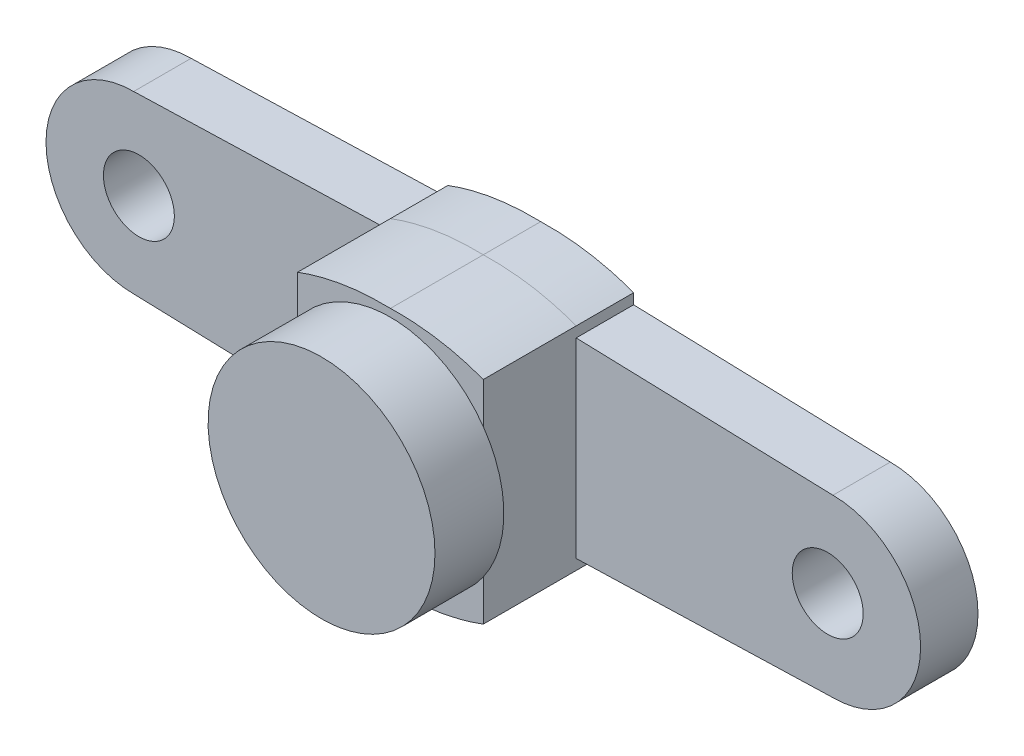
ISO-10303-21;
HEADER;
FILE_DESCRIPTION(('STEP AP214'),'2;1');
FILE_NAME('part.step','',(''),(''),'','','');
FILE_SCHEMA(('AUTOMOTIVE_DESIGN { 1 0 10303 214 1 1 1 1 }'));
ENDSEC;
DATA;
#1=APPLICATION_CONTEXT('core data for automotive mechanical design processes');
#2=APPLICATION_PROTOCOL_DEFINITION('international standard','automotive_design',2000,#1);
#3=PRODUCT_CONTEXT('',#1,'mechanical');
#4=PRODUCT('Part','Part','',(#3));
#5=PRODUCT_RELATED_PRODUCT_CATEGORY('part','',(#4));
#6=PRODUCT_DEFINITION_FORMATION('','',#4);
#7=PRODUCT_DEFINITION_CONTEXT('part definition',#1,'design');
#8=PRODUCT_DEFINITION('design','',#6,#7);
#9=PRODUCT_DEFINITION_SHAPE('','',#8);
#10=(LENGTH_UNIT() NAMED_UNIT(*) SI_UNIT(.MILLI.,.METRE.));
#11=(NAMED_UNIT(*) PLANE_ANGLE_UNIT() SI_UNIT($,.RADIAN.));
#12=(NAMED_UNIT(*) SI_UNIT($,.STERADIAN.) SOLID_ANGLE_UNIT());
#13=UNCERTAINTY_MEASURE_WITH_UNIT(LENGTH_MEASURE(1.E-05),#10,'distance_accuracy_value','');
#14=(GEOMETRIC_REPRESENTATION_CONTEXT(3) GLOBAL_UNCERTAINTY_ASSIGNED_CONTEXT((#13)) GLOBAL_UNIT_ASSIGNED_CONTEXT((#10,
#11,#12)) REPRESENTATION_CONTEXT('',''));
#15=CARTESIAN_POINT('',(0.,0.,0.));
#16=DIRECTION('',(0.,0.,1.));
#17=DIRECTION('',(1.,0.,0.));
#18=AXIS2_PLACEMENT_3D('',#15,#16,#17);
#19=CARTESIAN_POINT('',(8.4853000278855,7.91872101342506,7.2));
#20=DIRECTION('',(0.,0.,1.));
#21=DIRECTION('',(1.,0.,0.));
#22=AXIS2_PLACEMENT_3D('',#19,#20,#21);
#23=PLANE('',#22);
#24=CARTESIAN_POINT('',(4.61101000871711,2.64714357478906,7.2));
#25=DIRECTION('',(0.,0.,1.));
#26=DIRECTION('',(1.,0.,0.));
#27=AXIS2_PLACEMENT_3D('',#24,#25,#26);
#28=CIRCLE('',#27,5.435);
#29=CARTESIAN_POINT('',(9.06101002019817,5.76751613232423,7.2));
#30=VERTEX_POINT('',#29);
#31=CARTESIAN_POINT('',(0.161010020198166,5.76751616507078,7.2));
#32=VERTEX_POINT('',#31);
#33=EDGE_CURVE('E47',#30,#32,#28,.T.);
#34=ORIENTED_EDGE('',*,*,#33,.F.);
#35=DIRECTION('',(0.,1.,0.));
#36=VECTOR('',#35,1.);
#37=CARTESIAN_POINT('',(9.06101002019817,-1.93096476807348,7.2));
#38=LINE('',#37,#36);
#39=CARTESIAN_POINT('',(9.06101002019817,7.71966469580309,7.2));
#40=VERTEX_POINT('',#39);
#41=EDGE_CURVE('E178',#30,#40,#38,.T.);
#42=ORIENTED_EDGE('',*,*,#41,.T.);
#43=CARTESIAN_POINT('',(-296383.383400373,-955070.191119898,7.2));
#44=CARTESIAN_POINT('',(300907.39833334,953663.959511073,7.2));
#45=CARTESIAN_POINT('',(-305397.472066195,-952226.053018193,7.2));
#46=B_SPLINE_CURVE_WITH_KNOTS('',2,(#43,#44,#45),.UNSPECIFIED.,.F.,.F.,(3,3),(0.,1.),.UNSPECIFIED.);
#47=CARTESIAN_POINT('',(4.611010008714,8.44423367993897,7.2));
#48=VERTEX_POINT('',#47);
#49=EDGE_CURVE('E197',#40,#48,#46,.T.);
#50=ORIENTED_EDGE('',*,*,#49,.T.);
#51=CARTESIAN_POINT('',(305406.694086235,-952226.053018194,7.2));
#52=CARTESIAN_POINT('',(-300898.176313299,953663.959511073,7.2));
#53=CARTESIAN_POINT('',(296392.605420413,-955070.191119898,7.2));
#54=B_SPLINE_CURVE_WITH_KNOTS('',2,(#51,#52,#53),.UNSPECIFIED.,.F.,.F.,(3,3),(0.,1.),.UNSPECIFIED.);
#55=CARTESIAN_POINT('',(0.161010020010455,7.7196646957563,7.2));
#56=VERTEX_POINT('',#55);
#57=EDGE_CURVE('E203',#48,#56,#54,.T.);
#58=ORIENTED_EDGE('',*,*,#57,.T.);
#59=DIRECTION('',(0.,-1.,0.));
#60=VECTOR('',#59,1.);
#61=CARTESIAN_POINT('',(0.161010020198171,7.71966469580309,7.2));
#62=LINE('',#61,#60);
#63=EDGE_CURVE('E504',#56,#32,#62,.T.);
#64=ORIENTED_EDGE('',*,*,#63,.T.);
#65=EDGE_LOOP('',(#34,#42,#50,#58,#64));
#66=FACE_BOUND('',#65,.T.);
#67=ADVANCED_FACE('F35',(#66),#23,.T.);
#68=CARTESIAN_POINT('',(0.,0.,2.75));
#69=DIRECTION('',(0.,0.,1.));
#70=DIRECTION('',(1.,0.,0.));
#71=AXIS2_PLACEMENT_3D('',#68,#69,#70);
#72=PLANE('',#71);
#73=DIRECTION('',(0.,1.,0.));
#74=VECTOR('',#73,1.);
#75=CARTESIAN_POINT('',(9.06101002019817,7.71966469580309,2.75));
#76=LINE('',#75,#74);
#77=CARTESIAN_POINT('',(9.06101002019817,-1.93096476807348,2.75));
#78=VERTEX_POINT('',#77);
#79=CARTESIAN_POINT('',(9.06101002019817,7.21943212732004,2.75));
#80=VERTEX_POINT('',#79);
#81=EDGE_CURVE('E45',#78,#80,#76,.T.);
#82=ORIENTED_EDGE('',*,*,#81,.F.);
#83=DIRECTION('',(0.999535079285719,0.0304897569241027,0.));
#84=VECTOR('',#83,1.);
#85=CARTESIAN_POINT('',(0.0672706183174681,-2.20530924470558,2.75));
#86=LINE('',#85,#84);
#87=CARTESIAN_POINT('',(21.3610100201982,-1.55576632037672,2.75));
#88=VERTEX_POINT('',#87);
#89=EDGE_CURVE('E264',#78,#88,#86,.T.);
#90=ORIENTED_EDGE('',*,*,#89,.T.);
#91=CARTESIAN_POINT('',(21.3610100201982,2.64423367962328,2.75));
#92=DIRECTION('',(0.,0.,1.));
#93=DIRECTION('',(1.,0.,0.));
#94=AXIS2_PLACEMENT_3D('',#91,#92,#93);
#95=CIRCLE('',#94,4.2);
#96=CARTESIAN_POINT('',(21.3610100201982,6.84423367962328,2.75));
#97=VERTEX_POINT('',#96);
#98=EDGE_CURVE('E270',#88,#97,#95,.T.);
#99=ORIENTED_EDGE('',*,*,#98,.T.);
#100=DIRECTION('',(0.999535079285719,-0.0304897569241024,0.));
#101=VECTOR('',#100,1.);
#102=CARTESIAN_POINT('',(0.228439736887106,7.48886031101686,2.75));
#103=LINE('',#102,#101);
#104=EDGE_CURVE('E275',#80,#97,#103,.T.);
#105=ORIENTED_EDGE('',*,*,#104,.F.);
#106=EDGE_LOOP('',(#82,#90,#99,#105));
#107=FACE_BOUND('',#106,.T.);
#108=CARTESIAN_POINT('',(21.1110100201982,2.64553279413696,2.75));
#109=DIRECTION('',(0.,0.,1.));
#110=DIRECTION('',(-1.,0.,0.));
#111=AXIS2_PLACEMENT_3D('',#108,#109,#110);
#112=CIRCLE('',#111,1.7);
#113=CARTESIAN_POINT('',(19.4110100201982,2.64553279413696,2.75));
#114=VERTEX_POINT('',#113);
#115=EDGE_CURVE('E424',#114,#114,#112,.T.);
#116=ORIENTED_EDGE('',*,*,#115,.F.);
#117=EDGE_LOOP('',(#116));
#118=FACE_BOUND('',#117,.T.);
#119=ADVANCED_FACE('F232',(#107,#118),#72,.T.);
#120=CARTESIAN_POINT('',(4.61101002019817,8.44423367962328,2.75));
#121=CARTESIAN_POINT('',(6.97010391828629,8.50694060644477,2.75));
#122=CARTESIAN_POINT('',(9.06101002019817,7.71966469580309,2.75));
#123=B_SPLINE_CURVE_WITH_KNOTS('',2,(#120,#121,#122),.UNSPECIFIED.,.F.,.F.,(3,3),(0.,
0.687711527241185),.UNSPECIFIED.);
#124=DIRECTION('',(0.,0.,-1.));
#125=VECTOR('',#124,1.);
#126=SURFACE_OF_LINEAR_EXTRUSION('',#123,#125);
#127=CARTESIAN_POINT('',(4.61101002019817,8.44423367962328,0.));
#128=CARTESIAN_POINT('',(6.97010391828629,8.50694060644477,0.));
#129=CARTESIAN_POINT('',(9.06101002019817,7.71966469580309,0.));
#130=B_SPLINE_CURVE_WITH_KNOTS('',2,(#127,#128,#129),.UNSPECIFIED.,.F.,.F.,(3,3),(0.,
0.687711527241185),.UNSPECIFIED.);
#131=CARTESIAN_POINT('',(4.61101002019817,8.44423367962328,0.));
#132=VERTEX_POINT('',#131);
#133=CARTESIAN_POINT('',(9.06101002019817,7.71966469580309,0.));
#134=VERTEX_POINT('',#133);
#135=EDGE_CURVE('E276',#132,#134,#130,.T.);
#136=ORIENTED_EDGE('',*,*,#135,.F.);
#137=DIRECTION('',(0.,0.,-1.));
#138=VECTOR('',#137,1.);
#139=CARTESIAN_POINT('',(4.61101002019817,8.44423367962328,2.75));
#140=LINE('',#139,#138);
#141=CARTESIAN_POINT('',(4.61101002019817,8.44423367962328,2.75));
#142=VERTEX_POINT('',#141);
#143=EDGE_CURVE('E361',#142,#132,#140,.T.);
#144=ORIENTED_EDGE('',*,*,#143,.F.);
#145=CARTESIAN_POINT('',(9.06101002019817,7.71966469580309,2.75));
#146=VERTEX_POINT('',#145);
#147=EDGE_CURVE('E336',#142,#146,#123,.T.);
#148=ORIENTED_EDGE('',*,*,#147,.T.);
#149=DIRECTION('',(0.,0.,-1.));
#150=VECTOR('',#149,1.);
#151=CARTESIAN_POINT('',(9.06101002019817,7.71966469580309,2.75));
#152=LINE('',#151,#150);
#153=EDGE_CURVE('E337',#146,#134,#152,.T.);
#154=ORIENTED_EDGE('',*,*,#153,.T.);
#155=EDGE_LOOP('',(#136,#144,#148,#154));
#156=FACE_BOUND('',#155,.T.);
#157=ADVANCED_FACE('F37',(#156),#126,.T.);
#158=CARTESIAN_POINT('',(4.61101002019817,8.44423367962328,2.75));
#159=CARTESIAN_POINT('',(2.25191612211005,8.50694060644477,2.75));
#160=CARTESIAN_POINT('',(0.161010020198171,7.71966469580309,2.75));
#161=B_SPLINE_CURVE_WITH_KNOTS('',2,(#158,#159,#160),.UNSPECIFIED.,.F.,.F.,(3,3),(0.,
0.687711527241185),.UNSPECIFIED.);
#162=DIRECTION('',(0.,0.,-1.));
#163=VECTOR('',#162,1.);
#164=SURFACE_OF_LINEAR_EXTRUSION('',#161,#163);
#165=CARTESIAN_POINT('',(4.61101002019817,8.44423367962328,0.));
#166=CARTESIAN_POINT('',(2.25191612211005,8.50694060644477,0.));
#167=CARTESIAN_POINT('',(0.161010020198171,7.71966469580309,0.));
#168=B_SPLINE_CURVE_WITH_KNOTS('',2,(#165,#166,#167),.UNSPECIFIED.,.F.,.F.,(3,3),(0.,
0.687711527241185),.UNSPECIFIED.);
#169=CARTESIAN_POINT('',(0.161010020198171,7.71966469580309,0.));
#170=VERTEX_POINT('',#169);
#171=EDGE_CURVE('E281',#132,#170,#168,.T.);
#172=ORIENTED_EDGE('',*,*,#171,.T.);
#173=DIRECTION('',(0.,0.,-1.));
#174=VECTOR('',#173,1.);
#175=CARTESIAN_POINT('',(0.161010020198171,7.71966469580309,2.75));
#176=LINE('',#175,#174);
#177=CARTESIAN_POINT('',(0.161010020198171,7.71966469580309,2.75));
#178=VERTEX_POINT('',#177);
#179=EDGE_CURVE('E358',#178,#170,#176,.T.);
#180=ORIENTED_EDGE('',*,*,#179,.F.);
#181=EDGE_CURVE('E406',#142,#178,#161,.T.);
#182=ORIENTED_EDGE('',*,*,#181,.F.);
#183=ORIENTED_EDGE('',*,*,#143,.T.);
#184=EDGE_LOOP('',(#172,#180,#182,#183));
#185=FACE_BOUND('',#184,.T.);
#186=ADVANCED_FACE('F450',(#185),#164,.F.);
#187=CARTESIAN_POINT('',(-0.219866713949873,7.2078138867171,2.75));
#188=DIRECTION('',(0.0304897569241027,-0.999535079285719,0.));
#189=DIRECTION('',(0.999535079285719,0.0304897569241027,0.));
#190=AXIS2_PLACEMENT_3D('',#187,#188,#189);
#191=PLANE('',#190);
#192=DIRECTION('',(-0.999535079285719,-0.0304897569241027,0.));
#193=VECTOR('',#192,1.);
#194=CARTESIAN_POINT('',(-0.219866713949873,7.2078138867171,0.));
#195=LINE('',#194,#193);
#196=CARTESIAN_POINT('',(0.16101002019817,7.21943212732004,0.));
#197=VERTEX_POINT('',#196);
#198=CARTESIAN_POINT('',(-12.1389899798018,6.84423367962328,0.));
#199=VERTEX_POINT('',#198);
#200=EDGE_CURVE('E294',#197,#199,#195,.T.);
#201=ORIENTED_EDGE('',*,*,#200,.T.);
#202=DIRECTION('',(0.,0.,-1.));
#203=VECTOR('',#202,1.);
#204=CARTESIAN_POINT('',(-12.1389899798018,6.84423367962328,2.75));
#205=LINE('',#204,#203);
#206=CARTESIAN_POINT('',(-12.1389899798018,6.84423367962328,2.75));
#207=VERTEX_POINT('',#206);
#208=EDGE_CURVE('E355',#207,#199,#205,.T.);
#209=ORIENTED_EDGE('',*,*,#208,.F.);
#210=DIRECTION('',(-0.999535079285719,-0.0304897569241027,0.));
#211=VECTOR('',#210,1.);
#212=CARTESIAN_POINT('',(-0.219866713949873,7.2078138867171,2.75));
#213=LINE('',#212,#211);
#214=CARTESIAN_POINT('',(0.16101002019817,7.21943212732004,2.75));
#215=VERTEX_POINT('',#214);
#216=EDGE_CURVE('E445',#215,#207,#213,.T.);
#217=ORIENTED_EDGE('',*,*,#216,.F.);
#218=DIRECTION('',(0.,0.,-1.));
#219=VECTOR('',#218,1.);
#220=CARTESIAN_POINT('',(0.16101002019817,7.21943212732004,2.75));
#221=LINE('',#220,#219);
#222=EDGE_CURVE('E357',#215,#197,#221,.T.);
#223=ORIENTED_EDGE('',*,*,#222,.T.);
#224=EDGE_LOOP('',(#201,#209,#217,#223));
#225=FACE_BOUND('',#224,.T.);
#226=ADVANCED_FACE('F453',(#225),#191,.F.);
#227=CARTESIAN_POINT('',(-12.1389899798018,2.64423367962328,2.75));
#228=DIRECTION('',(0.,0.,-1.));
#229=DIRECTION('',(-1.,0.,0.));
#230=AXIS2_PLACEMENT_3D('',#227,#228,#229);
#231=CYLINDRICAL_SURFACE('',#230,4.2);
#232=CARTESIAN_POINT('',(-12.1389899798018,2.64423367962328,0.));
#233=DIRECTION('',(0.,0.,1.));
#234=DIRECTION('',(1.,0.,0.));
#235=AXIS2_PLACEMENT_3D('',#232,#233,#234);
#236=CIRCLE('',#235,4.2);
#237=CARTESIAN_POINT('',(-12.1389899798018,-1.55576632037672,0.));
#238=VERTEX_POINT('',#237);
#239=EDGE_CURVE('E297',#238,#199,#236,.F.);
#240=ORIENTED_EDGE('',*,*,#239,.F.);
#241=DIRECTION('',(0.,0.,-1.));
#242=VECTOR('',#241,1.);
#243=CARTESIAN_POINT('',(-12.1389899798018,-1.55576632037672,2.75));
#244=LINE('',#243,#242);
#245=CARTESIAN_POINT('',(-12.1389899798018,-1.55576632037672,2.75));
#246=VERTEX_POINT('',#245);
#247=EDGE_CURVE('E353',#246,#238,#244,.T.);
#248=ORIENTED_EDGE('',*,*,#247,.F.);
#249=CARTESIAN_POINT('',(-12.1389899798018,2.64423367962328,2.75));
#250=DIRECTION('',(0.,0.,1.));
#251=DIRECTION('',(1.,0.,0.));
#252=AXIS2_PLACEMENT_3D('',#249,#250,#251);
#253=CIRCLE('',#252,4.2);
#254=EDGE_CURVE('E446',#246,#207,#253,.F.);
#255=ORIENTED_EDGE('',*,*,#254,.T.);
#256=ORIENTED_EDGE('',*,*,#208,.T.);
#257=EDGE_LOOP('',(#240,#248,#255,#256));
#258=FACE_BOUND('',#257,.T.);
#259=ADVANCED_FACE('F457',(#258),#231,.T.);
#260=CARTESIAN_POINT('',(-0.0586975953802322,-1.92426282040583,2.75));
#261=DIRECTION('',(-0.0304897569241025,-0.999535079285719,0.));
#262=DIRECTION('',(0.999535079285719,-0.0304897569241025,0.));
#263=AXIS2_PLACEMENT_3D('',#260,#261,#262);
#264=PLANE('',#263);
#265=DIRECTION('',(-0.999535079285719,0.0304897569241025,0.));
#266=VECTOR('',#265,1.);
#267=CARTESIAN_POINT('',(-0.0586975953802322,-1.92426282040583,0.));
#268=LINE('',#267,#266);
#269=CARTESIAN_POINT('',(0.161010020198171,-1.93096476807348,0.));
#270=VERTEX_POINT('',#269);
#271=EDGE_CURVE('E300',#270,#238,#268,.T.);
#272=ORIENTED_EDGE('',*,*,#271,.F.);
#273=DIRECTION('',(0.,0.,-1.));
#274=VECTOR('',#273,1.);
#275=CARTESIAN_POINT('',(0.161010020198171,-1.93096476807348,2.75));
#276=LINE('',#275,#274);
#277=CARTESIAN_POINT('',(0.161010020198171,-1.93096476807348,2.75));
#278=VERTEX_POINT('',#277);
#279=EDGE_CURVE('E352',#278,#270,#276,.T.);
#280=ORIENTED_EDGE('',*,*,#279,.F.);
#281=DIRECTION('',(-0.999535079285719,0.0304897569241025,0.));
#282=VECTOR('',#281,1.);
#283=CARTESIAN_POINT('',(-0.0586975953802322,-1.92426282040583,2.75));
#284=LINE('',#283,#282);
#285=EDGE_CURVE('E526',#278,#246,#284,.T.);
#286=ORIENTED_EDGE('',*,*,#285,.T.);
#287=ORIENTED_EDGE('',*,*,#247,.T.);
#288=EDGE_LOOP('',(#272,#280,#286,#287));
#289=FACE_BOUND('',#288,.T.);
#290=ADVANCED_FACE('F461',(#289),#264,.T.);
#291=CARTESIAN_POINT('',(0.161010020198166,0.,2.75));
#292=DIRECTION('',(1.,0.,0.));
#293=DIRECTION('',(0.,1.,0.));
#294=AXIS2_PLACEMENT_3D('',#291,#292,#293);
#295=PLANE('',#294);
#296=DIRECTION('',(0.,-1.,0.));
#297=VECTOR('',#296,1.);
#298=CARTESIAN_POINT('',(0.161010020198166,0.,0.));
#299=LINE('',#298,#297);
#300=CARTESIAN_POINT('',(0.161010020198172,-2.43119733655653,0.));
#301=VERTEX_POINT('',#300);
#302=EDGE_CURVE('E303',#270,#301,#299,.T.);
#303=ORIENTED_EDGE('',*,*,#302,.T.);
#304=DIRECTION('',(0.,0.,-1.));
#305=VECTOR('',#304,1.);
#306=CARTESIAN_POINT('',(0.161010020198172,-2.43119733655653,2.75));
#307=LINE('',#306,#305);
#308=CARTESIAN_POINT('',(0.161010020198172,-2.43119733655653,2.75));
#309=VERTEX_POINT('',#308);
#310=EDGE_CURVE('E350',#309,#301,#307,.T.);
#311=ORIENTED_EDGE('',*,*,#310,.F.);
#312=DIRECTION('',(0.,0.,-1.));
#313=VECTOR('',#312,1.);
#314=CARTESIAN_POINT('',(0.161010020198172,-2.43119733655653,7.2));
#315=LINE('',#314,#313);
#316=CARTESIAN_POINT('',(0.161010020198172,-2.43119733655653,7.2));
#317=VERTEX_POINT('',#316);
#318=EDGE_CURVE('E415',#317,#309,#315,.T.);
#319=ORIENTED_EDGE('',*,*,#318,.F.);
#320=CARTESIAN_POINT('',(0.161010020198153,-0.473229015492628,7.2));
#321=VERTEX_POINT('',#320);
#322=EDGE_CURVE('E509',#321,#317,#62,.T.);
#323=ORIENTED_EDGE('',*,*,#322,.F.);
#324=EDGE_CURVE('E508',#32,#321,#62,.T.);
#325=ORIENTED_EDGE('',*,*,#324,.F.);
#326=ORIENTED_EDGE('',*,*,#63,.F.);
#327=DIRECTION('',(0.,0.,-1.));
#328=VECTOR('',#327,1.);
#329=CARTESIAN_POINT('',(0.161010020010455,7.7196646957563,7.2));
#330=LINE('',#329,#328);
#331=EDGE_CURVE('E418',#56,#178,#330,.T.);
#332=ORIENTED_EDGE('',*,*,#331,.T.);
#333=ORIENTED_EDGE('',*,*,#179,.T.);
#334=DIRECTION('',(0.,-1.,0.));
#335=VECTOR('',#334,1.);
#336=CARTESIAN_POINT('',(0.161010020198154,0.,0.));
#337=LINE('',#336,#335);
#338=EDGE_CURVE('E289',#170,#197,#337,.T.);
#339=ORIENTED_EDGE('',*,*,#338,.T.);
#340=ORIENTED_EDGE('',*,*,#222,.F.);
#341=DIRECTION('',(0.,-1.,0.));
#342=VECTOR('',#341,1.);
#343=CARTESIAN_POINT('',(0.161010020198171,-1.93096476807348,2.75));
#344=LINE('',#343,#342);
#345=EDGE_CURVE('E363',#215,#278,#344,.T.);
#346=ORIENTED_EDGE('',*,*,#345,.T.);
#347=ORIENTED_EDGE('',*,*,#279,.T.);
#348=EDGE_LOOP('',(#303,#311,#319,#323,#325,#326,#332,#333,#339,#340,#346,#347));
#349=FACE_BOUND('',#348,.T.);
#350=ADVANCED_FACE('F464',(#349),#295,.F.);
#351=CARTESIAN_POINT('',(4.61101002019817,-3.15576632037672,2.75));
#352=CARTESIAN_POINT('',(2.25191612211005,-3.21847324719821,2.75));
#353=CARTESIAN_POINT('',(0.161010020198172,-2.43119733655653,2.75));
#354=B_SPLINE_CURVE_WITH_KNOTS('',2,(#351,#352,#353),.UNSPECIFIED.,.F.,.F.,(3,3),(0.,
0.687711527241185),.UNSPECIFIED.);
#355=DIRECTION('',(0.,0.,-1.));
#356=VECTOR('',#355,1.);
#357=SURFACE_OF_LINEAR_EXTRUSION('',#354,#356);
#358=CARTESIAN_POINT('',(4.61101002019817,-3.15576632037672,0.));
#359=CARTESIAN_POINT('',(2.25191612211005,-3.21847324719821,0.));
#360=CARTESIAN_POINT('',(0.161010020198172,-2.43119733655653,0.));
#361=B_SPLINE_CURVE_WITH_KNOTS('',2,(#358,#359,#360),.UNSPECIFIED.,.F.,.F.,(3,3),(0.,
0.687711527241185),.UNSPECIFIED.);
#362=CARTESIAN_POINT('',(4.61101002019817,-3.15576632037672,0.));
#363=VERTEX_POINT('',#362);
#364=EDGE_CURVE('E306',#363,#301,#361,.T.);
#365=ORIENTED_EDGE('',*,*,#364,.F.);
#366=DIRECTION('',(0.,0.,-1.));
#367=VECTOR('',#366,1.);
#368=CARTESIAN_POINT('',(4.61101002019817,-3.15576632037672,2.75));
#369=LINE('',#368,#367);
#370=CARTESIAN_POINT('',(4.61101002019817,-3.15576632037672,2.75));
#371=VERTEX_POINT('',#370);
#372=EDGE_CURVE('E348',#371,#363,#369,.T.);
#373=ORIENTED_EDGE('',*,*,#372,.F.);
#374=EDGE_CURVE('E265',#371,#309,#354,.T.);
#375=ORIENTED_EDGE('',*,*,#374,.T.);
#376=ORIENTED_EDGE('',*,*,#310,.T.);
#377=EDGE_LOOP('',(#365,#373,#375,#376));
#378=FACE_BOUND('',#377,.T.);
#379=ADVANCED_FACE('F254',(#378),#357,.T.);
#380=CARTESIAN_POINT('',(4.61101002019817,-3.15576632037672,2.75));
#381=CARTESIAN_POINT('',(6.97010391828629,-3.21847324719821,2.75));
#382=CARTESIAN_POINT('',(9.06101002019817,-2.43119733655653,2.75));
#383=B_SPLINE_CURVE_WITH_KNOTS('',2,(#380,#381,#382),.UNSPECIFIED.,.F.,.F.,(3,3),(0.,
0.687711527241185),.UNSPECIFIED.);
#384=DIRECTION('',(0.,0.,-1.));
#385=VECTOR('',#384,1.);
#386=SURFACE_OF_LINEAR_EXTRUSION('',#383,#385);
#387=CARTESIAN_POINT('',(4.61101002019817,-3.15576632037672,0.));
#388=CARTESIAN_POINT('',(6.97010391828629,-3.21847324719821,0.));
#389=CARTESIAN_POINT('',(9.06101002019817,-2.43119733655653,0.));
#390=B_SPLINE_CURVE_WITH_KNOTS('',2,(#387,#388,#389),.UNSPECIFIED.,.F.,.F.,(3,3),(0.,
0.687711527241185),.UNSPECIFIED.);
#391=CARTESIAN_POINT('',(9.06101002019817,-2.43119733655653,0.));
#392=VERTEX_POINT('',#391);
#393=EDGE_CURVE('E311',#363,#392,#390,.T.);
#394=ORIENTED_EDGE('',*,*,#393,.T.);
#395=DIRECTION('',(0.,0.,-1.));
#396=VECTOR('',#395,1.);
#397=CARTESIAN_POINT('',(9.06101002019817,-2.43119733655653,2.75));
#398=LINE('',#397,#396);
#399=CARTESIAN_POINT('',(9.06101002019817,-2.43119733655653,2.75));
#400=VERTEX_POINT('',#399);
#401=EDGE_CURVE('E346',#400,#392,#398,.T.);
#402=ORIENTED_EDGE('',*,*,#401,.F.);
#403=EDGE_CURVE('E258',#371,#400,#383,.T.);
#404=ORIENTED_EDGE('',*,*,#403,.F.);
#405=ORIENTED_EDGE('',*,*,#372,.T.);
#406=EDGE_LOOP('',(#394,#402,#404,#405));
#407=FACE_BOUND('',#406,.T.);
#408=ADVANCED_FACE('F249',(#407),#386,.F.);
#409=CARTESIAN_POINT('',(0.0672706183174681,-2.20530924470558,2.75));
#410=DIRECTION('',(-0.0304897569241027,0.999535079285719,0.));
#411=DIRECTION('',(-0.999535079285719,-0.0304897569241027,0.));
#412=AXIS2_PLACEMENT_3D('',#409,#410,#411);
#413=PLANE('',#412);
#414=DIRECTION('',(0.999535079285719,0.0304897569241027,0.));
#415=VECTOR('',#414,1.);
#416=CARTESIAN_POINT('',(0.0672706183174681,-2.20530924470558,0.));
#417=LINE('',#416,#415);
#418=CARTESIAN_POINT('',(9.06101002019817,-1.93096476807348,0.));
#419=VERTEX_POINT('',#418);
#420=CARTESIAN_POINT('',(21.3610100201982,-1.55576632037672,0.));
#421=VERTEX_POINT('',#420);
#422=EDGE_CURVE('E325',#419,#421,#417,.T.);
#423=ORIENTED_EDGE('',*,*,#422,.T.);
#424=DIRECTION('',(0.,0.,-1.));
#425=VECTOR('',#424,1.);
#426=CARTESIAN_POINT('',(21.3610100201982,-1.55576632037672,2.75));
#427=LINE('',#426,#425);
#428=EDGE_CURVE('E342',#88,#421,#427,.T.);
#429=ORIENTED_EDGE('',*,*,#428,.F.);
#430=ORIENTED_EDGE('',*,*,#89,.F.);
#431=DIRECTION('',(0.,0.,-1.));
#432=VECTOR('',#431,1.);
#433=CARTESIAN_POINT('',(9.06101002019817,-1.93096476807348,2.75));
#434=LINE('',#433,#432);
#435=EDGE_CURVE('E345',#78,#419,#434,.T.);
#436=ORIENTED_EDGE('',*,*,#435,.T.);
#437=EDGE_LOOP('',(#423,#429,#430,#436));
#438=FACE_BOUND('',#437,.T.);
#439=ADVANCED_FACE('F245',(#438),#413,.F.);
#440=CARTESIAN_POINT('',(21.3610100201982,2.64423367962328,2.75));
#441=DIRECTION('',(0.,0.,-1.));
#442=DIRECTION('',(-1.,0.,0.));
#443=AXIS2_PLACEMENT_3D('',#440,#441,#442);
#444=CYLINDRICAL_SURFACE('',#443,4.2);
#445=CARTESIAN_POINT('',(21.3610100201982,2.64423367962328,0.));
#446=DIRECTION('',(0.,0.,1.));
#447=DIRECTION('',(1.,0.,0.));
#448=AXIS2_PLACEMENT_3D('',#445,#446,#447);
#449=CIRCLE('',#448,4.2);
#450=CARTESIAN_POINT('',(21.3610100201982,6.84423367962328,0.));
#451=VERTEX_POINT('',#450);
#452=EDGE_CURVE('E327',#421,#451,#449,.T.);
#453=ORIENTED_EDGE('',*,*,#452,.T.);
#454=DIRECTION('',(0.,0.,-1.));
#455=VECTOR('',#454,1.);
#456=CARTESIAN_POINT('',(21.3610100201982,6.84423367962328,2.75));
#457=LINE('',#456,#455);
#458=EDGE_CURVE('E340',#97,#451,#457,.T.);
#459=ORIENTED_EDGE('',*,*,#458,.F.);
#460=ORIENTED_EDGE('',*,*,#98,.F.);
#461=ORIENTED_EDGE('',*,*,#428,.T.);
#462=EDGE_LOOP('',(#453,#459,#460,#461));
#463=FACE_BOUND('',#462,.T.);
#464=ADVANCED_FACE('F241',(#463),#444,.T.);
#465=CARTESIAN_POINT('',(0.228439736887106,7.48886031101686,2.75));
#466=DIRECTION('',(0.0304897569241024,0.999535079285719,0.));
#467=DIRECTION('',(-0.999535079285719,0.0304897569241024,0.));
#468=AXIS2_PLACEMENT_3D('',#465,#466,#467);
#469=PLANE('',#468);
#470=DIRECTION('',(0.999535079285719,-0.0304897569241024,0.));
#471=VECTOR('',#470,1.);
#472=CARTESIAN_POINT('',(0.228439736887106,7.48886031101686,0.));
#473=LINE('',#472,#471);
#474=CARTESIAN_POINT('',(9.06101002019817,7.21943212732004,0.));
#475=VERTEX_POINT('',#474);
#476=EDGE_CURVE('E330',#475,#451,#473,.T.);
#477=ORIENTED_EDGE('',*,*,#476,.F.);
#478=DIRECTION('',(0.,0.,-1.));
#479=VECTOR('',#478,1.);
#480=CARTESIAN_POINT('',(9.06101002019817,7.21943212732004,2.75));
#481=LINE('',#480,#479);
#482=EDGE_CURVE('E339',#80,#475,#481,.T.);
#483=ORIENTED_EDGE('',*,*,#482,.F.);
#484=ORIENTED_EDGE('',*,*,#104,.T.);
#485=ORIENTED_EDGE('',*,*,#458,.T.);
#486=EDGE_LOOP('',(#477,#483,#484,#485));
#487=FACE_BOUND('',#486,.T.);
#488=ADVANCED_FACE('F238',(#487),#469,.T.);
#489=CARTESIAN_POINT('',(9.06101002019817,0.,2.75));
#490=DIRECTION('',(1.,0.,0.));
#491=DIRECTION('',(0.,0.,-1.));
#492=AXIS2_PLACEMENT_3D('',#489,#490,#491);
#493=PLANE('',#492);
#494=DIRECTION('',(0.,-1.,0.));
#495=VECTOR('',#494,1.);
#496=CARTESIAN_POINT('',(9.06101002019817,0.,0.));
#497=LINE('',#496,#495);
#498=EDGE_CURVE('E333',#134,#475,#497,.T.);
#499=ORIENTED_EDGE('',*,*,#498,.F.);
#500=ORIENTED_EDGE('',*,*,#153,.F.);
#501=DIRECTION('',(0.,0.,-1.));
#502=VECTOR('',#501,1.);
#503=CARTESIAN_POINT('',(9.06101002019817,7.71966469580309,7.2));
#504=LINE('',#503,#502);
#505=EDGE_CURVE('E175',#40,#146,#504,.T.);
#506=ORIENTED_EDGE('',*,*,#505,.F.);
#507=ORIENTED_EDGE('',*,*,#41,.F.);
#508=CARTESIAN_POINT('',(9.06101002019817,-0.4732289827461,7.2));
#509=VERTEX_POINT('',#508);
#510=EDGE_CURVE('E176',#509,#30,#38,.T.);
#511=ORIENTED_EDGE('',*,*,#510,.F.);
#512=CARTESIAN_POINT('',(9.06101002035653,-2.43119733638525,7.2));
#513=VERTEX_POINT('',#512);
#514=EDGE_CURVE('E167',#513,#509,#38,.T.);
#515=ORIENTED_EDGE('',*,*,#514,.F.);
#516=DIRECTION('',(0.,0.,-1.));
#517=VECTOR('',#516,1.);
#518=CARTESIAN_POINT('',(9.06101002035653,-2.43119733638525,7.2));
#519=LINE('',#518,#517);
#520=EDGE_CURVE('E407',#513,#400,#519,.T.);
#521=ORIENTED_EDGE('',*,*,#520,.T.);
#522=ORIENTED_EDGE('',*,*,#401,.T.);
#523=DIRECTION('',(0.,-1.,0.));
#524=VECTOR('',#523,1.);
#525=CARTESIAN_POINT('',(9.06101002019817,0.,0.));
#526=LINE('',#525,#524);
#527=EDGE_CURVE('E319',#419,#392,#526,.T.);
#528=ORIENTED_EDGE('',*,*,#527,.F.);
#529=ORIENTED_EDGE('',*,*,#435,.F.);
#530=ORIENTED_EDGE('',*,*,#81,.T.);
#531=ORIENTED_EDGE('',*,*,#482,.T.);
#532=EDGE_LOOP('',(#499,#500,#506,#507,#511,#515,#521,#522,#528,#529,#530,#531));
#533=FACE_BOUND('',#532,.T.);
#534=ADVANCED_FACE('F182',(#533),#493,.T.);
#535=ORIENTED_EDGE('',*,*,#345,.F.);
#536=ORIENTED_EDGE('',*,*,#216,.T.);
#537=ORIENTED_EDGE('',*,*,#254,.F.);
#538=ORIENTED_EDGE('',*,*,#285,.F.);
#539=EDGE_LOOP('',(#535,#536,#537,#538));
#540=FACE_BOUND('',#539,.T.);
#541=CARTESIAN_POINT('',(-11.8889899798018,2.64553279413696,2.75));
#542=DIRECTION('',(0.,0.,1.));
#543=DIRECTION('',(1.,0.,0.));
#544=AXIS2_PLACEMENT_3D('',#541,#542,#543);
#545=CIRCLE('',#544,1.7);
#546=CARTESIAN_POINT('',(-10.1889899798018,2.64553279413696,2.75));
#547=VERTEX_POINT('',#546);
#548=EDGE_CURVE('E428',#547,#547,#545,.T.);
#549=ORIENTED_EDGE('',*,*,#548,.F.);
#550=EDGE_LOOP('',(#549));
#551=FACE_BOUND('',#550,.T.);
#552=ADVANCED_FACE('F228',(#540,#551),#72,.T.);
#553=CARTESIAN_POINT('',(0.,0.,0.));
#554=DIRECTION('',(0.,0.,1.));
#555=DIRECTION('',(1.,0.,0.));
#556=AXIS2_PLACEMENT_3D('',#553,#554,#555);
#557=PLANE('',#556);
#558=CARTESIAN_POINT('',(21.1110100201982,2.64553279413696,0.));
#559=DIRECTION('',(0.,0.,1.));
#560=DIRECTION('',(-1.,0.,0.));
#561=AXIS2_PLACEMENT_3D('',#558,#559,#560);
#562=CIRCLE('',#561,1.7);
#563=CARTESIAN_POINT('',(19.4110100201982,2.64553279413696,0.));
#564=VERTEX_POINT('',#563);
#565=EDGE_CURVE('E425',#564,#564,#562,.T.);
#566=ORIENTED_EDGE('',*,*,#565,.T.);
#567=EDGE_LOOP('',(#566));
#568=FACE_BOUND('',#567,.T.);
#569=CARTESIAN_POINT('',(-11.8889899798018,2.64553279413696,0.));
#570=DIRECTION('',(0.,0.,1.));
#571=DIRECTION('',(1.,0.,0.));
#572=AXIS2_PLACEMENT_3D('',#569,#570,#571);
#573=CIRCLE('',#572,1.7);
#574=CARTESIAN_POINT('',(-10.1889899798018,2.64553279413696,0.));
#575=VERTEX_POINT('',#574);
#576=EDGE_CURVE('E282',#575,#575,#573,.T.);
#577=ORIENTED_EDGE('',*,*,#576,.T.);
#578=EDGE_LOOP('',(#577));
#579=FACE_BOUND('',#578,.T.);
#580=ORIENTED_EDGE('',*,*,#135,.T.);
#581=ORIENTED_EDGE('',*,*,#498,.T.);
#582=ORIENTED_EDGE('',*,*,#476,.T.);
#583=ORIENTED_EDGE('',*,*,#452,.F.);
#584=ORIENTED_EDGE('',*,*,#422,.F.);
#585=ORIENTED_EDGE('',*,*,#527,.T.);
#586=ORIENTED_EDGE('',*,*,#393,.F.);
#587=ORIENTED_EDGE('',*,*,#364,.T.);
#588=ORIENTED_EDGE('',*,*,#302,.F.);
#589=ORIENTED_EDGE('',*,*,#271,.T.);
#590=ORIENTED_EDGE('',*,*,#239,.T.);
#591=ORIENTED_EDGE('',*,*,#200,.F.);
#592=ORIENTED_EDGE('',*,*,#338,.F.);
#593=ORIENTED_EDGE('',*,*,#171,.F.);
#594=EDGE_LOOP('',(#580,#581,#582,#583,#584,#585,#586,#587,#588,#589,#590,#591,#592,#593));
#595=FACE_BOUND('',#594,.T.);
#596=ADVANCED_FACE('F226',(#568,#579,#595),#557,.F.);
#597=CARTESIAN_POINT('',(-11.8889899798018,2.64553279413696,0.));
#598=DIRECTION('',(0.,0.,1.));
#599=DIRECTION('',(1.,0.,0.));
#600=AXIS2_PLACEMENT_3D('',#597,#598,#599);
#601=CYLINDRICAL_SURFACE('',#600,1.7);
#602=ORIENTED_EDGE('',*,*,#576,.F.);
#603=EDGE_LOOP('',(#602));
#604=FACE_BOUND('',#603,.T.);
#605=ORIENTED_EDGE('',*,*,#548,.T.);
#606=EDGE_LOOP('',(#605));
#607=FACE_BOUND('',#606,.T.);
#608=ADVANCED_FACE('F222',(#604,#607),#601,.F.);
#609=CARTESIAN_POINT('',(21.1110100201982,2.64553279413696,0.));
#610=DIRECTION('',(0.,0.,1.));
#611=DIRECTION('',(1.,0.,0.));
#612=AXIS2_PLACEMENT_3D('',#609,#610,#611);
#613=CYLINDRICAL_SURFACE('',#612,1.7);
#614=ORIENTED_EDGE('',*,*,#565,.F.);
#615=EDGE_LOOP('',(#614));
#616=FACE_BOUND('',#615,.T.);
#617=ORIENTED_EDGE('',*,*,#115,.T.);
#618=EDGE_LOOP('',(#617));
#619=FACE_BOUND('',#618,.T.);
#620=ADVANCED_FACE('F217',(#616,#619),#613,.F.);
#621=DIRECTION('',(0.,0.,-1.));
#622=VECTOR('',#621,1.);
#623=SURFACE_OF_LINEAR_EXTRUSION('',#46,#622);
#624=ORIENTED_EDGE('',*,*,#147,.F.);
#625=DIRECTION('',(0.,0.,-1.));
#626=VECTOR('',#625,1.);
#627=CARTESIAN_POINT('',(4.611010008714,8.44423367993897,7.2));
#628=LINE('',#627,#626);
#629=EDGE_CURVE('E421',#48,#142,#628,.T.);
#630=ORIENTED_EDGE('',*,*,#629,.F.);
#631=ORIENTED_EDGE('',*,*,#49,.F.);
#632=ORIENTED_EDGE('',*,*,#505,.T.);
#633=EDGE_LOOP('',(#624,#630,#631,#632));
#634=FACE_BOUND('',#633,.T.);
#635=ADVANCED_FACE('F212',(#634),#623,.F.);
#636=DIRECTION('',(0.,0.,-1.));
#637=VECTOR('',#636,1.);
#638=SURFACE_OF_LINEAR_EXTRUSION('',#54,#637);
#639=ORIENTED_EDGE('',*,*,#181,.T.);
#640=ORIENTED_EDGE('',*,*,#331,.F.);
#641=ORIENTED_EDGE('',*,*,#57,.F.);
#642=ORIENTED_EDGE('',*,*,#629,.T.);
#643=EDGE_LOOP('',(#639,#640,#641,#642));
#644=FACE_BOUND('',#643,.T.);
#645=ADVANCED_FACE('F216',(#644),#638,.F.);
#646=CARTESIAN_POINT('',(296392.605420412,955075.479587258,7.2));
#647=CARTESIAN_POINT('',(-300898.176313298,-953658.671043714,7.2));
#648=CARTESIAN_POINT('',(305406.694086234,952231.341485554,7.2));
#649=B_SPLINE_CURVE_WITH_KNOTS('',2,(#646,#647,#648),.UNSPECIFIED.,.F.,.F.,(3,3),(0.,1.),.UNSPECIFIED.);
#650=DIRECTION('',(0.,0.,-1.));
#651=VECTOR('',#650,1.);
#652=SURFACE_OF_LINEAR_EXTRUSION('',#649,#651);
#653=ORIENTED_EDGE('',*,*,#374,.F.);
#654=DIRECTION('',(0.,0.,-1.));
#655=VECTOR('',#654,1.);
#656=CARTESIAN_POINT('',(4.61101000871711,-3.15576632067799,7.2));
#657=LINE('',#656,#655);
#658=CARTESIAN_POINT('',(4.61101000871711,-3.15576632067799,7.2));
#659=VERTEX_POINT('',#658);
#660=EDGE_CURVE('E409',#659,#371,#657,.T.);
#661=ORIENTED_EDGE('',*,*,#660,.F.);
#662=EDGE_CURVE('E497',#317,#659,#649,.T.);
#663=ORIENTED_EDGE('',*,*,#662,.F.);
#664=ORIENTED_EDGE('',*,*,#318,.T.);
#665=EDGE_LOOP('',(#653,#661,#663,#664));
#666=FACE_BOUND('',#665,.T.);
#667=ADVANCED_FACE('F487',(#666),#652,.F.);
#668=CARTESIAN_POINT('',(-305397.472066194,952231.341485553,7.2));
#669=CARTESIAN_POINT('',(300907.398333339,-953658.671043714,7.2));
#670=CARTESIAN_POINT('',(-296383.383400372,955075.479587258,7.2));
#671=B_SPLINE_CURVE_WITH_KNOTS('',2,(#668,#669,#670),.UNSPECIFIED.,.F.,.F.,(3,3),(0.,1.),.UNSPECIFIED.);
#672=DIRECTION('',(0.,0.,-1.));
#673=VECTOR('',#672,1.);
#674=SURFACE_OF_LINEAR_EXTRUSION('',#671,#673);
#675=ORIENTED_EDGE('',*,*,#403,.T.);
#676=ORIENTED_EDGE('',*,*,#520,.F.);
#677=EDGE_CURVE('E171',#659,#513,#671,.T.);
#678=ORIENTED_EDGE('',*,*,#677,.F.);
#679=ORIENTED_EDGE('',*,*,#660,.T.);
#680=EDGE_LOOP('',(#675,#676,#678,#679));
#681=FACE_BOUND('',#680,.T.);
#682=ADVANCED_FACE('F481',(#681),#674,.F.);
#683=EDGE_CURVE('E11',#321,#509,#28,.T.);
#684=ORIENTED_EDGE('',*,*,#683,.F.);
#685=ORIENTED_EDGE('',*,*,#322,.T.);
#686=ORIENTED_EDGE('',*,*,#662,.T.);
#687=ORIENTED_EDGE('',*,*,#677,.T.);
#688=ORIENTED_EDGE('',*,*,#514,.T.);
#689=EDGE_LOOP('',(#684,#685,#686,#687,#688));
#690=FACE_BOUND('',#689,.T.);
#691=ADVANCED_FACE('F169',(#690),#23,.T.);
#692=CARTESIAN_POINT('',(4.61101000871711,2.64714357478906,7.2));
#693=DIRECTION('',(0.,0.,1.));
#694=DIRECTION('',(1.,0.,0.));
#695=AXIS2_PLACEMENT_3D('',#692,#693,#694);
#696=PLANE('',#695);
#697=EDGE_CURVE('E48',#32,#321,#28,.T.);
#698=ORIENTED_EDGE('',*,*,#697,.F.);
#699=ORIENTED_EDGE('',*,*,#324,.T.);
#700=EDGE_LOOP('',(#698,#699));
#701=FACE_BOUND('',#700,.T.);
#702=ADVANCED_FACE('F480',(#701),#696,.F.);
#703=EDGE_CURVE('E186',#509,#30,#28,.T.);
#704=ORIENTED_EDGE('',*,*,#703,.F.);
#705=ORIENTED_EDGE('',*,*,#510,.T.);
#706=EDGE_LOOP('',(#704,#705));
#707=FACE_BOUND('',#706,.T.);
#708=ADVANCED_FACE('F187',(#707),#696,.F.);
#709=CARTESIAN_POINT('',(4.61101000871711,2.64714357478906,10.5));
#710=DIRECTION('',(0.,0.,-1.));
#711=DIRECTION('',(-1.,0.,0.));
#712=AXIS2_PLACEMENT_3D('',#709,#710,#711);
#713=CYLINDRICAL_SURFACE('',#712,5.435);
#714=CARTESIAN_POINT('',(4.61101000871711,2.64714357478906,10.5));
#715=DIRECTION('',(0.,0.,1.));
#716=DIRECTION('',(1.,0.,0.));
#717=AXIS2_PLACEMENT_3D('',#714,#715,#716);
#718=CIRCLE('',#717,5.435);
#719=CARTESIAN_POINT('',(10.0460100087171,2.64714357478906,10.5));
#720=VERTEX_POINT('',#719);
#721=EDGE_CURVE('E194',#720,#720,#718,.T.);
#722=ORIENTED_EDGE('',*,*,#721,.F.);
#723=EDGE_LOOP('',(#722));
#724=FACE_BOUND('',#723,.T.);
#725=ORIENTED_EDGE('',*,*,#33,.T.);
#726=ORIENTED_EDGE('',*,*,#697,.T.);
#727=ORIENTED_EDGE('',*,*,#683,.T.);
#728=ORIENTED_EDGE('',*,*,#703,.T.);
#729=EDGE_LOOP('',(#725,#726,#727,#728));
#730=FACE_BOUND('',#729,.T.);
#731=ADVANCED_FACE('F190',(#724,#730),#713,.T.);
#732=CARTESIAN_POINT('',(4.61101000871711,2.64714357478906,10.5));
#733=DIRECTION('',(0.,0.,1.));
#734=DIRECTION('',(1.,0.,0.));
#735=AXIS2_PLACEMENT_3D('',#732,#733,#734);
#736=PLANE('',#735);
#737=ORIENTED_EDGE('',*,*,#721,.T.);
#738=EDGE_LOOP('',(#737));
#739=FACE_BOUND('',#738,.T.);
#740=ADVANCED_FACE('F604',(#739),#736,.T.);
#741=CLOSED_SHELL('',(#67,#119,#157,#186,#226,#259,#290,#350,#379,#408,#439,#464,#488,#534,#552,
#596,#608,#620,#635,#645,#667,#682,#691,#702,#708,#731,#740));
#742=MANIFOLD_SOLID_BREP('B2',#741);
#743=ADVANCED_BREP_SHAPE_REPRESENTATION('',(#18,#742),#14);
#744=SHAPE_DEFINITION_REPRESENTATION(#9,#743);
ENDSEC;
END-ISO-10303-21;
